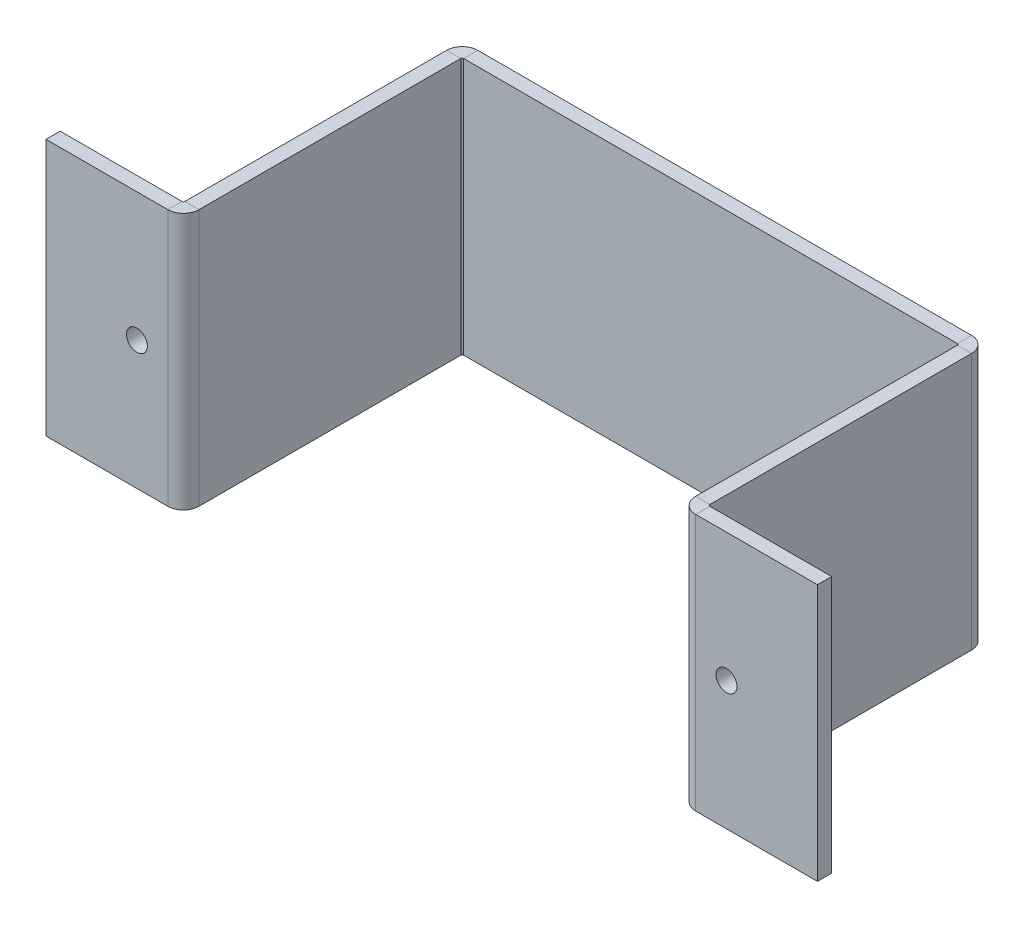
ISO-10303-21;
HEADER;
FILE_DESCRIPTION(('STEP AP214'),'2;1');
FILE_NAME('part.step','',(''),(''),'','','');
FILE_SCHEMA(('AUTOMOTIVE_DESIGN { 1 0 10303 214 1 1 1 1 }'));
ENDSEC;
DATA;
#1=APPLICATION_CONTEXT('core data for automotive mechanical design processes');
#2=APPLICATION_PROTOCOL_DEFINITION('international standard','automotive_design',2000,#1);
#3=PRODUCT_CONTEXT('',#1,'mechanical');
#4=PRODUCT('Part','Part','',(#3));
#5=PRODUCT_RELATED_PRODUCT_CATEGORY('part','',(#4));
#6=PRODUCT_DEFINITION_FORMATION('','',#4);
#7=PRODUCT_DEFINITION_CONTEXT('part definition',#1,'design');
#8=PRODUCT_DEFINITION('design','',#6,#7);
#9=PRODUCT_DEFINITION_SHAPE('','',#8);
#10=(LENGTH_UNIT() NAMED_UNIT(*) SI_UNIT(.MILLI.,.METRE.));
#11=(NAMED_UNIT(*) PLANE_ANGLE_UNIT() SI_UNIT($,.RADIAN.));
#12=(NAMED_UNIT(*) SI_UNIT($,.STERADIAN.) SOLID_ANGLE_UNIT());
#13=UNCERTAINTY_MEASURE_WITH_UNIT(LENGTH_MEASURE(1.E-05),#10,'distance_accuracy_value','');
#14=(GEOMETRIC_REPRESENTATION_CONTEXT(3) GLOBAL_UNCERTAINTY_ASSIGNED_CONTEXT((#13)) GLOBAL_UNIT_ASSIGNED_CONTEXT((#10,
#11,#12)) REPRESENTATION_CONTEXT('',''));
#15=CARTESIAN_POINT('',(0.,0.,0.));
#16=DIRECTION('',(0.,0.,1.));
#17=DIRECTION('',(1.,0.,0.));
#18=AXIS2_PLACEMENT_3D('',#15,#16,#17);
#19=CARTESIAN_POINT('',(45.14,-15.035,-0.83));
#20=DIRECTION('',(0.,0.,1.));
#21=DIRECTION('',(1.,0.,0.));
#22=AXIS2_PLACEMENT_3D('',#19,#20,#21);
#23=PLANE('',#22);
#24=DIRECTION('',(-1.,0.,0.));
#25=VECTOR('',#24,1.);
#26=CARTESIAN_POINT('',(45.14,15.035,-0.83));
#27=LINE('',#26,#25);
#28=CARTESIAN_POINT('',(45.14,15.035,-0.83));
#29=VERTEX_POINT('',#28);
#30=CARTESIAN_POINT('',(30.89,15.035,-0.830000000000008));
#31=VERTEX_POINT('',#30);
#32=EDGE_CURVE('E199',#29,#31,#27,.T.);
#33=ORIENTED_EDGE('',*,*,#32,.F.);
#34=DIRECTION('',(0.,1.,0.));
#35=VECTOR('',#34,1.);
#36=CARTESIAN_POINT('',(45.14,-15.035,-0.83));
#37=LINE('',#36,#35);
#38=CARTESIAN_POINT('',(45.14,-15.035,-0.83));
#39=VERTEX_POINT('',#38);
#40=EDGE_CURVE('E192',#39,#29,#37,.T.);
#41=ORIENTED_EDGE('',*,*,#40,.F.);
#42=DIRECTION('',(-1.,0.,0.));
#43=VECTOR('',#42,1.);
#44=CARTESIAN_POINT('',(45.14,-15.035,-0.83));
#45=LINE('',#44,#43);
#46=CARTESIAN_POINT('',(30.89,-15.035,-0.830000000000008));
#47=VERTEX_POINT('',#46);
#48=EDGE_CURVE('E197',#39,#47,#45,.T.);
#49=ORIENTED_EDGE('',*,*,#48,.T.);
#50=DIRECTION('',(0.,1.,0.));
#51=VECTOR('',#50,1.);
#52=CARTESIAN_POINT('',(30.89,-15.035,-0.830000000000008));
#53=LINE('',#52,#51);
#54=EDGE_CURVE('E217',#47,#31,#53,.T.);
#55=ORIENTED_EDGE('',*,*,#54,.T.);
#56=EDGE_LOOP('',(#33,#41,#49,#55));
#57=FACE_BOUND('',#56,.T.);
#58=CARTESIAN_POINT('',(34.5,0.,-0.830000000000006));
#59=DIRECTION('',(0.,0.,1.));
#60=DIRECTION('',(1.,0.,0.));
#61=AXIS2_PLACEMENT_3D('',#58,#59,#60);
#62=CIRCLE('',#61,3.17500000000001);
#63=CARTESIAN_POINT('',(37.675,0.,-0.830000000000004));
#64=VERTEX_POINT('',#63);
#65=EDGE_CURVE('E11',#64,#64,#62,.F.);
#66=ORIENTED_EDGE('',*,*,#65,.F.);
#67=EDGE_LOOP('',(#66));
#68=FACE_BOUND('',#67,.T.);
#69=ADVANCED_FACE('F33',(#57,#68),#23,.F.);
#70=CARTESIAN_POINT('',(45.14,0.,0.));
#71=DIRECTION('',(-1.,0.,0.));
#72=DIRECTION('',(0.,0.,1.));
#73=AXIS2_PLACEMENT_3D('',#70,#71,#72);
#74=PLANE('',#73);
#75=ORIENTED_EDGE('',*,*,#40,.T.);
#76=DIRECTION('',(0.,0.,1.));
#77=VECTOR('',#76,1.);
#78=CARTESIAN_POINT('',(45.14,15.035,0.83));
#79=LINE('',#78,#77);
#80=CARTESIAN_POINT('',(45.14,15.035,0.83));
#81=VERTEX_POINT('',#80);
#82=EDGE_CURVE('E202',#29,#81,#79,.T.);
#83=ORIENTED_EDGE('',*,*,#82,.T.);
#84=DIRECTION('',(0.,-1.,0.));
#85=VECTOR('',#84,1.);
#86=CARTESIAN_POINT('',(45.14,-15.035,0.83));
#87=LINE('',#86,#85);
#88=CARTESIAN_POINT('',(45.14,-15.035,0.83));
#89=VERTEX_POINT('',#88);
#90=EDGE_CURVE('E207',#81,#89,#87,.T.);
#91=ORIENTED_EDGE('',*,*,#90,.T.);
#92=DIRECTION('',(0.,0.,-1.));
#93=VECTOR('',#92,1.);
#94=CARTESIAN_POINT('',(45.14,-15.035,0.83));
#95=LINE('',#94,#93);
#96=EDGE_CURVE('E206',#89,#39,#95,.T.);
#97=ORIENTED_EDGE('',*,*,#96,.T.);
#98=EDGE_LOOP('',(#75,#83,#91,#97));
#99=FACE_BOUND('',#98,.T.);
#100=ADVANCED_FACE('F35',(#99),#74,.F.);
#101=CARTESIAN_POINT('',(-45.14,0.,0.));
#102=DIRECTION('',(-1.,0.,0.));
#103=DIRECTION('',(0.,0.,1.));
#104=AXIS2_PLACEMENT_3D('',#101,#102,#103);
#105=PLANE('',#104);
#106=DIRECTION('',(0.,1.,0.));
#107=VECTOR('',#106,1.);
#108=CARTESIAN_POINT('',(-45.14,-15.035,-0.829999999999976));
#109=LINE('',#108,#107);
#110=CARTESIAN_POINT('',(-45.14,-15.035,-0.829999999999976));
#111=VERTEX_POINT('',#110);
#112=CARTESIAN_POINT('',(-45.14,15.035,-0.829999999999976));
#113=VERTEX_POINT('',#112);
#114=EDGE_CURVE('E295',#111,#113,#109,.T.);
#115=ORIENTED_EDGE('',*,*,#114,.F.);
#116=DIRECTION('',(0.,0.,-1.));
#117=VECTOR('',#116,1.);
#118=CARTESIAN_POINT('',(-45.14,-15.035,0.830000000000024));
#119=LINE('',#118,#117);
#120=CARTESIAN_POINT('',(-45.14,-15.035,0.830000000000024));
#121=VERTEX_POINT('',#120);
#122=EDGE_CURVE('E41',#121,#111,#119,.T.);
#123=ORIENTED_EDGE('',*,*,#122,.F.);
#124=DIRECTION('',(0.,-1.,0.));
#125=VECTOR('',#124,1.);
#126=CARTESIAN_POINT('',(-45.14,-15.035,0.830000000000024));
#127=LINE('',#126,#125);
#128=CARTESIAN_POINT('',(-45.14,15.035,0.830000000000024));
#129=VERTEX_POINT('',#128);
#130=EDGE_CURVE('E48',#129,#121,#127,.T.);
#131=ORIENTED_EDGE('',*,*,#130,.F.);
#132=DIRECTION('',(0.,0.,1.));
#133=VECTOR('',#132,1.);
#134=CARTESIAN_POINT('',(-45.14,15.035,0.830000000000024));
#135=LINE('',#134,#133);
#136=EDGE_CURVE('E57',#113,#129,#135,.T.);
#137=ORIENTED_EDGE('',*,*,#136,.F.);
#138=EDGE_LOOP('',(#115,#123,#131,#137));
#139=FACE_BOUND('',#138,.T.);
#140=ADVANCED_FACE('F411',(#139),#105,.T.);
#141=CARTESIAN_POINT('',(45.14,15.035,0.83));
#142=DIRECTION('',(0.,-1.,0.));
#143=DIRECTION('',(0.,0.,-1.));
#144=AXIS2_PLACEMENT_3D('',#141,#142,#143);
#145=PLANE('',#144);
#146=DIRECTION('',(-1.,0.,0.));
#147=VECTOR('',#146,1.);
#148=CARTESIAN_POINT('',(45.14,15.035,0.83));
#149=LINE('',#148,#147);
#150=CARTESIAN_POINT('',(30.89,15.035,0.829999999999992));
#151=VERTEX_POINT('',#150);
#152=EDGE_CURVE('E306',#81,#151,#149,.T.);
#153=ORIENTED_EDGE('',*,*,#152,.F.);
#154=ORIENTED_EDGE('',*,*,#82,.F.);
#155=ORIENTED_EDGE('',*,*,#32,.T.);
#156=DIRECTION('',(0.,0.,1.));
#157=VECTOR('',#156,1.);
#158=CARTESIAN_POINT('',(30.89,15.035,0.829999999999992));
#159=LINE('',#158,#157);
#160=EDGE_CURVE('E303',#31,#151,#159,.T.);
#161=ORIENTED_EDGE('',*,*,#160,.T.);
#162=EDGE_LOOP('',(#153,#154,#155,#161));
#163=FACE_BOUND('',#162,.T.);
#164=ADVANCED_FACE('F489',(#163),#145,.F.);
#165=CARTESIAN_POINT('',(45.14,-15.035,0.83));
#166=DIRECTION('',(0.,0.,-1.));
#167=DIRECTION('',(-1.,0.,0.));
#168=AXIS2_PLACEMENT_3D('',#165,#166,#167);
#169=PLANE('',#168);
#170=CARTESIAN_POINT('',(34.5,0.,0.830000000000024));
#171=DIRECTION('',(0.,0.,-1.));
#172=DIRECTION('',(-1.,0.,0.));
#173=AXIS2_PLACEMENT_3D('',#170,#171,#172);
#174=CIRCLE('',#173,1.225);
#175=CARTESIAN_POINT('',(33.275,0.,0.830000000000024));
#176=VERTEX_POINT('',#175);
#177=EDGE_CURVE('E203',#176,#176,#174,.T.);
#178=ORIENTED_EDGE('',*,*,#177,.T.);
#179=EDGE_LOOP('',(#178));
#180=FACE_BOUND('',#179,.T.);
#181=DIRECTION('',(-1.,0.,0.));
#182=VECTOR('',#181,1.);
#183=CARTESIAN_POINT('',(45.14,-15.035,0.83));
#184=LINE('',#183,#182);
#185=CARTESIAN_POINT('',(30.89,-15.035,0.829999999999992));
#186=VERTEX_POINT('',#185);
#187=EDGE_CURVE('E354',#89,#186,#184,.T.);
#188=ORIENTED_EDGE('',*,*,#187,.F.);
#189=ORIENTED_EDGE('',*,*,#90,.F.);
#190=ORIENTED_EDGE('',*,*,#152,.T.);
#191=DIRECTION('',(0.,-1.,0.));
#192=VECTOR('',#191,1.);
#193=CARTESIAN_POINT('',(30.89,-15.035,0.829999999999992));
#194=LINE('',#193,#192);
#195=EDGE_CURVE('E309',#151,#186,#194,.T.);
#196=ORIENTED_EDGE('',*,*,#195,.T.);
#197=EDGE_LOOP('',(#188,#189,#190,#196));
#198=FACE_BOUND('',#197,.T.);
#199=ADVANCED_FACE('F492',(#180,#198),#169,.F.);
#200=CARTESIAN_POINT('',(45.14,-15.035,0.83));
#201=DIRECTION('',(0.,1.,0.));
#202=DIRECTION('',(0.,0.,1.));
#203=AXIS2_PLACEMENT_3D('',#200,#201,#202);
#204=PLANE('',#203);
#205=DIRECTION('',(0.,0.,-1.));
#206=VECTOR('',#205,1.);
#207=CARTESIAN_POINT('',(30.89,-15.035,0.829999999999992));
#208=LINE('',#207,#206);
#209=EDGE_CURVE('E215',#186,#47,#208,.T.);
#210=ORIENTED_EDGE('',*,*,#209,.T.);
#211=ORIENTED_EDGE('',*,*,#48,.F.);
#212=ORIENTED_EDGE('',*,*,#96,.F.);
#213=ORIENTED_EDGE('',*,*,#187,.T.);
#214=EDGE_LOOP('',(#210,#211,#212,#213));
#215=FACE_BOUND('',#214,.T.);
#216=ADVANCED_FACE('F213',(#215),#204,.F.);
#217=CARTESIAN_POINT('',(30.89,0.,-1.00000000000001));
#218=DIRECTION('',(0.,-1.,0.));
#219=DIRECTION('',(0.,0.,-1.));
#220=AXIS2_PLACEMENT_3D('',#217,#218,#219);
#221=CYLINDRICAL_SURFACE('',#220,0.170000000000022);
#222=CARTESIAN_POINT('',(30.89,15.035,-1.00000000000001));
#223=DIRECTION('',(0.,-1.,0.));
#224=DIRECTION('',(0.,0.,1.));
#225=AXIS2_PLACEMENT_3D('',#222,#223,#224);
#226=CIRCLE('',#225,0.170000000000022);
#227=CARTESIAN_POINT('',(30.72,15.035,-1.00000000000001));
#228=VERTEX_POINT('',#227);
#229=EDGE_CURVE('E225',#31,#228,#226,.T.);
#230=ORIENTED_EDGE('',*,*,#229,.F.);
#231=ORIENTED_EDGE('',*,*,#54,.F.);
#232=CARTESIAN_POINT('',(30.89,-15.035,-1.00000000000001));
#233=DIRECTION('',(0.,-1.,0.));
#234=DIRECTION('',(0.,0.,1.));
#235=AXIS2_PLACEMENT_3D('',#232,#233,#234);
#236=CIRCLE('',#235,0.170000000000022);
#237=CARTESIAN_POINT('',(30.72,-15.035,-1.00000000000001));
#238=VERTEX_POINT('',#237);
#239=EDGE_CURVE('E226',#47,#238,#236,.T.);
#240=ORIENTED_EDGE('',*,*,#239,.T.);
#241=DIRECTION('',(0.,1.,0.));
#242=VECTOR('',#241,1.);
#243=CARTESIAN_POINT('',(30.72,-15.035,-1.00000000000001));
#244=LINE('',#243,#242);
#245=EDGE_CURVE('E222',#238,#228,#244,.T.);
#246=ORIENTED_EDGE('',*,*,#245,.T.);
#247=EDGE_LOOP('',(#230,#231,#240,#246));
#248=FACE_BOUND('',#247,.T.);
#249=ADVANCED_FACE('F448',(#248),#221,.F.);
#250=CARTESIAN_POINT('',(30.89,15.035,0.830000000000015));
#251=DIRECTION('',(0.,-1.,0.));
#252=DIRECTION('',(0.,0.,-1.));
#253=AXIS2_PLACEMENT_3D('',#250,#251,#252);
#254=PLANE('',#253);
#255=CARTESIAN_POINT('',(30.89,15.035,-1.00000000000001));
#256=DIRECTION('',(0.,-1.,0.));
#257=DIRECTION('',(0.,0.,1.));
#258=AXIS2_PLACEMENT_3D('',#255,#256,#257);
#259=CIRCLE('',#258,1.83000000000002);
#260=CARTESIAN_POINT('',(29.06,15.035,-1.00000000000001));
#261=VERTEX_POINT('',#260);
#262=EDGE_CURVE('E312',#151,#261,#259,.T.);
#263=ORIENTED_EDGE('',*,*,#262,.F.);
#264=ORIENTED_EDGE('',*,*,#160,.F.);
#265=ORIENTED_EDGE('',*,*,#229,.T.);
#266=DIRECTION('',(-1.,0.,0.));
#267=VECTOR('',#266,1.);
#268=CARTESIAN_POINT('',(29.06,15.035,-1.00000000000001));
#269=LINE('',#268,#267);
#270=EDGE_CURVE('E229',#228,#261,#269,.T.);
#271=ORIENTED_EDGE('',*,*,#270,.T.);
#272=EDGE_LOOP('',(#263,#264,#265,#271));
#273=FACE_BOUND('',#272,.T.);
#274=ADVANCED_FACE('F451',(#273),#254,.F.);
#275=CARTESIAN_POINT('',(30.89,0.,-1.00000000000001));
#276=DIRECTION('',(0.,-1.,0.));
#277=DIRECTION('',(0.,0.,-1.));
#278=AXIS2_PLACEMENT_3D('',#275,#276,#277);
#279=CYLINDRICAL_SURFACE('',#278,1.83000000000002);
#280=CARTESIAN_POINT('',(30.89,-15.035,-1.00000000000001));
#281=DIRECTION('',(0.,-1.,0.));
#282=DIRECTION('',(0.,0.,1.));
#283=AXIS2_PLACEMENT_3D('',#280,#281,#282);
#284=CIRCLE('',#283,1.83000000000002);
#285=CARTESIAN_POINT('',(29.06,-15.035,-1.00000000000001));
#286=VERTEX_POINT('',#285);
#287=EDGE_CURVE('E358',#186,#286,#284,.T.);
#288=ORIENTED_EDGE('',*,*,#287,.F.);
#289=ORIENTED_EDGE('',*,*,#195,.F.);
#290=ORIENTED_EDGE('',*,*,#262,.T.);
#291=DIRECTION('',(0.,-1.,0.));
#292=VECTOR('',#291,1.);
#293=CARTESIAN_POINT('',(29.06,-15.035,-1.00000000000001));
#294=LINE('',#293,#292);
#295=EDGE_CURVE('E315',#261,#286,#294,.T.);
#296=ORIENTED_EDGE('',*,*,#295,.T.);
#297=EDGE_LOOP('',(#288,#289,#290,#296));
#298=FACE_BOUND('',#297,.T.);
#299=ADVANCED_FACE('F496',(#298),#279,.T.);
#300=CARTESIAN_POINT('',(30.89,-15.035,0.830000000000015));
#301=DIRECTION('',(0.,1.,0.));
#302=DIRECTION('',(0.,0.,1.));
#303=AXIS2_PLACEMENT_3D('',#300,#301,#302);
#304=PLANE('',#303);
#305=DIRECTION('',(1.,0.,0.));
#306=VECTOR('',#305,1.);
#307=CARTESIAN_POINT('',(29.06,-15.035,-1.00000000000001));
#308=LINE('',#307,#306);
#309=EDGE_CURVE('E242',#286,#238,#308,.T.);
#310=ORIENTED_EDGE('',*,*,#309,.T.);
#311=ORIENTED_EDGE('',*,*,#239,.F.);
#312=ORIENTED_EDGE('',*,*,#209,.F.);
#313=ORIENTED_EDGE('',*,*,#287,.T.);
#314=EDGE_LOOP('',(#310,#311,#312,#313));
#315=FACE_BOUND('',#314,.T.);
#316=ADVANCED_FACE('F457',(#315),#304,.F.);
#317=CARTESIAN_POINT('',(30.72,-15.035,-1.00000000000001));
#318=DIRECTION('',(-1.,0.,0.));
#319=DIRECTION('',(0.,0.,1.));
#320=AXIS2_PLACEMENT_3D('',#317,#318,#319);
#321=PLANE('',#320);
#322=DIRECTION('',(0.,0.,-1.));
#323=VECTOR('',#322,1.);
#324=CARTESIAN_POINT('',(30.72,15.035,-1.00000000000001));
#325=LINE('',#324,#323);
#326=CARTESIAN_POINT('',(30.72,15.035,-31.63));
#327=VERTEX_POINT('',#326);
#328=EDGE_CURVE('E235',#228,#327,#325,.T.);
#329=ORIENTED_EDGE('',*,*,#328,.F.);
#330=ORIENTED_EDGE('',*,*,#245,.F.);
#331=DIRECTION('',(0.,0.,-1.));
#332=VECTOR('',#331,1.);
#333=CARTESIAN_POINT('',(30.72,-15.035,-1.00000000000001));
#334=LINE('',#333,#332);
#335=CARTESIAN_POINT('',(30.72,-15.035,-31.63));
#336=VERTEX_POINT('',#335);
#337=EDGE_CURVE('E236',#238,#336,#334,.T.);
#338=ORIENTED_EDGE('',*,*,#337,.T.);
#339=DIRECTION('',(0.,1.,0.));
#340=VECTOR('',#339,1.);
#341=CARTESIAN_POINT('',(30.72,-15.035,-31.63));
#342=LINE('',#341,#340);
#343=EDGE_CURVE('E232',#336,#327,#342,.T.);
#344=ORIENTED_EDGE('',*,*,#343,.T.);
#345=EDGE_LOOP('',(#329,#330,#338,#344));
#346=FACE_BOUND('',#345,.T.);
#347=ADVANCED_FACE('F453',(#346),#321,.F.);
#348=CARTESIAN_POINT('',(29.06,15.035,-1.00000000000001));
#349=DIRECTION('',(0.,-1.,0.));
#350=DIRECTION('',(0.,0.,-1.));
#351=AXIS2_PLACEMENT_3D('',#348,#349,#350);
#352=PLANE('',#351);
#353=DIRECTION('',(0.,0.,-1.));
#354=VECTOR('',#353,1.);
#355=CARTESIAN_POINT('',(29.06,15.035,-1.00000000000001));
#356=LINE('',#355,#354);
#357=CARTESIAN_POINT('',(29.06,15.035,-31.63));
#358=VERTEX_POINT('',#357);
#359=EDGE_CURVE('E318',#261,#358,#356,.T.);
#360=ORIENTED_EDGE('',*,*,#359,.F.);
#361=ORIENTED_EDGE('',*,*,#270,.F.);
#362=ORIENTED_EDGE('',*,*,#328,.T.);
#363=DIRECTION('',(-1.,0.,0.));
#364=VECTOR('',#363,1.);
#365=CARTESIAN_POINT('',(29.06,15.035,-31.63));
#366=LINE('',#365,#364);
#367=EDGE_CURVE('E239',#327,#358,#366,.T.);
#368=ORIENTED_EDGE('',*,*,#367,.T.);
#369=EDGE_LOOP('',(#360,#361,#362,#368));
#370=FACE_BOUND('',#369,.T.);
#371=ADVANCED_FACE('F456',(#370),#352,.F.);
#372=CARTESIAN_POINT('',(29.06,-15.035,-1.00000000000001));
#373=DIRECTION('',(1.,0.,0.));
#374=DIRECTION('',(0.,0.,-1.));
#375=AXIS2_PLACEMENT_3D('',#372,#373,#374);
#376=PLANE('',#375);
#377=DIRECTION('',(0.,0.,-1.));
#378=VECTOR('',#377,1.);
#379=CARTESIAN_POINT('',(29.06,-15.035,-1.00000000000001));
#380=LINE('',#379,#378);
#381=CARTESIAN_POINT('',(29.06,-15.035,-31.63));
#382=VERTEX_POINT('',#381);
#383=EDGE_CURVE('E363',#286,#382,#380,.T.);
#384=ORIENTED_EDGE('',*,*,#383,.F.);
#385=ORIENTED_EDGE('',*,*,#295,.F.);
#386=ORIENTED_EDGE('',*,*,#359,.T.);
#387=DIRECTION('',(0.,-1.,0.));
#388=VECTOR('',#387,1.);
#389=CARTESIAN_POINT('',(29.06,-15.035,-31.63));
#390=LINE('',#389,#388);
#391=EDGE_CURVE('E321',#358,#382,#390,.T.);
#392=ORIENTED_EDGE('',*,*,#391,.T.);
#393=EDGE_LOOP('',(#384,#385,#386,#392));
#394=FACE_BOUND('',#393,.T.);
#395=ADVANCED_FACE('F500',(#394),#376,.F.);
#396=CARTESIAN_POINT('',(29.06,-15.035,-1.00000000000001));
#397=DIRECTION('',(0.,1.,0.));
#398=DIRECTION('',(0.,0.,1.));
#399=AXIS2_PLACEMENT_3D('',#396,#397,#398);
#400=PLANE('',#399);
#401=DIRECTION('',(1.,0.,0.));
#402=VECTOR('',#401,1.);
#403=CARTESIAN_POINT('',(29.06,-15.035,-31.63));
#404=LINE('',#403,#402);
#405=EDGE_CURVE('E253',#382,#336,#404,.T.);
#406=ORIENTED_EDGE('',*,*,#405,.T.);
#407=ORIENTED_EDGE('',*,*,#337,.F.);
#408=ORIENTED_EDGE('',*,*,#309,.F.);
#409=ORIENTED_EDGE('',*,*,#383,.T.);
#410=EDGE_LOOP('',(#406,#407,#408,#409));
#411=FACE_BOUND('',#410,.T.);
#412=ADVANCED_FACE('F463',(#411),#400,.F.);
#413=CARTESIAN_POINT('',(28.89,0.,-31.63));
#414=DIRECTION('',(0.,1.,0.));
#415=DIRECTION('',(0.,0.,1.));
#416=AXIS2_PLACEMENT_3D('',#413,#414,#415);
#417=CYLINDRICAL_SURFACE('',#416,1.83000000000001);
#418=CARTESIAN_POINT('',(28.89,15.035,-31.63));
#419=DIRECTION('',(0.,1.,0.));
#420=DIRECTION('',(1.,0.,0.));
#421=AXIS2_PLACEMENT_3D('',#418,#419,#420);
#422=CIRCLE('',#421,1.83000000000001);
#423=CARTESIAN_POINT('',(28.89,15.035,-33.46));
#424=VERTEX_POINT('',#423);
#425=EDGE_CURVE('E246',#327,#424,#422,.T.);
#426=ORIENTED_EDGE('',*,*,#425,.F.);
#427=ORIENTED_EDGE('',*,*,#343,.F.);
#428=CARTESIAN_POINT('',(28.89,-15.035,-31.63));
#429=DIRECTION('',(0.,1.,0.));
#430=DIRECTION('',(1.,0.,0.));
#431=AXIS2_PLACEMENT_3D('',#428,#429,#430);
#432=CIRCLE('',#431,1.83000000000001);
#433=CARTESIAN_POINT('',(28.89,-15.035,-33.46));
#434=VERTEX_POINT('',#433);
#435=EDGE_CURVE('E247',#336,#434,#432,.T.);
#436=ORIENTED_EDGE('',*,*,#435,.T.);
#437=DIRECTION('',(0.,1.,0.));
#438=VECTOR('',#437,1.);
#439=CARTESIAN_POINT('',(28.89,-15.035,-33.46));
#440=LINE('',#439,#438);
#441=EDGE_CURVE('E243',#434,#424,#440,.T.);
#442=ORIENTED_EDGE('',*,*,#441,.T.);
#443=EDGE_LOOP('',(#426,#427,#436,#442));
#444=FACE_BOUND('',#443,.T.);
#445=ADVANCED_FACE('F459',(#444),#417,.T.);
#446=CARTESIAN_POINT('',(29.06,15.035,-31.63));
#447=DIRECTION('',(0.,-1.,0.));
#448=DIRECTION('',(0.,0.,-1.));
#449=AXIS2_PLACEMENT_3D('',#446,#447,#448);
#450=PLANE('',#449);
#451=CARTESIAN_POINT('',(28.89,15.035,-31.63));
#452=DIRECTION('',(0.,1.,0.));
#453=DIRECTION('',(1.,0.,0.));
#454=AXIS2_PLACEMENT_3D('',#451,#452,#453);
#455=CIRCLE('',#454,0.170000000000003);
#456=CARTESIAN_POINT('',(28.89,15.035,-31.8));
#457=VERTEX_POINT('',#456);
#458=EDGE_CURVE('E324',#358,#457,#455,.T.);
#459=ORIENTED_EDGE('',*,*,#458,.F.);
#460=ORIENTED_EDGE('',*,*,#367,.F.);
#461=ORIENTED_EDGE('',*,*,#425,.T.);
#462=DIRECTION('',(0.,0.,1.));
#463=VECTOR('',#462,1.);
#464=CARTESIAN_POINT('',(28.89,15.035,-31.8));
#465=LINE('',#464,#463);
#466=EDGE_CURVE('E250',#424,#457,#465,.T.);
#467=ORIENTED_EDGE('',*,*,#466,.T.);
#468=EDGE_LOOP('',(#459,#460,#461,#467));
#469=FACE_BOUND('',#468,.T.);
#470=ADVANCED_FACE('F462',(#469),#450,.F.);
#471=CARTESIAN_POINT('',(28.89,0.,-31.63));
#472=DIRECTION('',(0.,1.,0.));
#473=DIRECTION('',(0.,0.,1.));
#474=AXIS2_PLACEMENT_3D('',#471,#472,#473);
#475=CYLINDRICAL_SURFACE('',#474,0.170000000000003);
#476=CARTESIAN_POINT('',(28.89,-15.035,-31.63));
#477=DIRECTION('',(0.,1.,0.));
#478=DIRECTION('',(1.,0.,0.));
#479=AXIS2_PLACEMENT_3D('',#476,#477,#478);
#480=CIRCLE('',#479,0.170000000000003);
#481=CARTESIAN_POINT('',(28.89,-15.035,-31.8));
#482=VERTEX_POINT('',#481);
#483=EDGE_CURVE('E368',#382,#482,#480,.T.);
#484=ORIENTED_EDGE('',*,*,#483,.F.);
#485=ORIENTED_EDGE('',*,*,#391,.F.);
#486=ORIENTED_EDGE('',*,*,#458,.T.);
#487=DIRECTION('',(0.,-1.,0.));
#488=VECTOR('',#487,1.);
#489=CARTESIAN_POINT('',(28.89,-15.035,-31.8));
#490=LINE('',#489,#488);
#491=EDGE_CURVE('E327',#457,#482,#490,.T.);
#492=ORIENTED_EDGE('',*,*,#491,.T.);
#493=EDGE_LOOP('',(#484,#485,#486,#492));
#494=FACE_BOUND('',#493,.T.);
#495=ADVANCED_FACE('F504',(#494),#475,.F.);
#496=CARTESIAN_POINT('',(29.06,-15.035,-31.63));
#497=DIRECTION('',(0.,1.,0.));
#498=DIRECTION('',(0.,0.,1.));
#499=AXIS2_PLACEMENT_3D('',#496,#497,#498);
#500=PLANE('',#499);
#501=DIRECTION('',(0.,0.,-1.));
#502=VECTOR('',#501,1.);
#503=CARTESIAN_POINT('',(28.89,-15.035,-31.8));
#504=LINE('',#503,#502);
#505=EDGE_CURVE('E264',#482,#434,#504,.T.);
#506=ORIENTED_EDGE('',*,*,#505,.T.);
#507=ORIENTED_EDGE('',*,*,#435,.F.);
#508=ORIENTED_EDGE('',*,*,#405,.F.);
#509=ORIENTED_EDGE('',*,*,#483,.T.);
#510=EDGE_LOOP('',(#506,#507,#508,#509));
#511=FACE_BOUND('',#510,.T.);
#512=ADVANCED_FACE('F469',(#511),#500,.F.);
#513=CARTESIAN_POINT('',(28.89,-15.035,-33.46));
#514=DIRECTION('',(0.,0.,1.));
#515=DIRECTION('',(1.,0.,0.));
#516=AXIS2_PLACEMENT_3D('',#513,#514,#515);
#517=PLANE('',#516);
#518=DIRECTION('',(-1.,0.,0.));
#519=VECTOR('',#518,1.);
#520=CARTESIAN_POINT('',(28.89,15.035,-33.46));
#521=LINE('',#520,#519);
#522=CARTESIAN_POINT('',(-28.89,15.035,-33.46));
#523=VERTEX_POINT('',#522);
#524=EDGE_CURVE('E257',#424,#523,#521,.T.);
#525=ORIENTED_EDGE('',*,*,#524,.F.);
#526=ORIENTED_EDGE('',*,*,#441,.F.);
#527=DIRECTION('',(-1.,0.,0.));
#528=VECTOR('',#527,1.);
#529=CARTESIAN_POINT('',(28.89,-15.035,-33.46));
#530=LINE('',#529,#528);
#531=CARTESIAN_POINT('',(-28.89,-15.035,-33.46));
#532=VERTEX_POINT('',#531);
#533=EDGE_CURVE('E258',#434,#532,#530,.T.);
#534=ORIENTED_EDGE('',*,*,#533,.T.);
#535=DIRECTION('',(0.,1.,0.));
#536=VECTOR('',#535,1.);
#537=CARTESIAN_POINT('',(-28.89,-15.035,-33.46));
#538=LINE('',#537,#536);
#539=EDGE_CURVE('E254',#532,#523,#538,.T.);
#540=ORIENTED_EDGE('',*,*,#539,.T.);
#541=EDGE_LOOP('',(#525,#526,#534,#540));
#542=FACE_BOUND('',#541,.T.);
#543=ADVANCED_FACE('F465',(#542),#517,.F.);
#544=CARTESIAN_POINT('',(28.89,15.035,-31.8));
#545=DIRECTION('',(0.,-1.,0.));
#546=DIRECTION('',(0.,0.,-1.));
#547=AXIS2_PLACEMENT_3D('',#544,#545,#546);
#548=PLANE('',#547);
#549=DIRECTION('',(-1.,0.,0.));
#550=VECTOR('',#549,1.);
#551=CARTESIAN_POINT('',(28.89,15.035,-31.8));
#552=LINE('',#551,#550);
#553=CARTESIAN_POINT('',(-28.89,15.035,-31.8));
#554=VERTEX_POINT('',#553);
#555=EDGE_CURVE('E330',#457,#554,#552,.T.);
#556=ORIENTED_EDGE('',*,*,#555,.F.);
#557=ORIENTED_EDGE('',*,*,#466,.F.);
#558=ORIENTED_EDGE('',*,*,#524,.T.);
#559=DIRECTION('',(0.,0.,1.));
#560=VECTOR('',#559,1.);
#561=CARTESIAN_POINT('',(-28.89,15.035,-31.8));
#562=LINE('',#561,#560);
#563=EDGE_CURVE('E261',#523,#554,#562,.T.);
#564=ORIENTED_EDGE('',*,*,#563,.T.);
#565=EDGE_LOOP('',(#556,#557,#558,#564));
#566=FACE_BOUND('',#565,.T.);
#567=ADVANCED_FACE('F468',(#566),#548,.F.);
#568=CARTESIAN_POINT('',(28.89,-15.035,-31.8));
#569=DIRECTION('',(0.,0.,-1.));
#570=DIRECTION('',(-1.,0.,0.));
#571=AXIS2_PLACEMENT_3D('',#568,#569,#570);
#572=PLANE('',#571);
#573=DIRECTION('',(-1.,0.,0.));
#574=VECTOR('',#573,1.);
#575=CARTESIAN_POINT('',(28.89,-15.035,-31.8));
#576=LINE('',#575,#574);
#577=CARTESIAN_POINT('',(-28.89,-15.035,-31.8));
#578=VERTEX_POINT('',#577);
#579=EDGE_CURVE('E373',#482,#578,#576,.T.);
#580=ORIENTED_EDGE('',*,*,#579,.F.);
#581=ORIENTED_EDGE('',*,*,#491,.F.);
#582=ORIENTED_EDGE('',*,*,#555,.T.);
#583=DIRECTION('',(0.,-1.,0.));
#584=VECTOR('',#583,1.);
#585=CARTESIAN_POINT('',(-28.89,-15.035,-31.8));
#586=LINE('',#585,#584);
#587=EDGE_CURVE('E333',#554,#578,#586,.T.);
#588=ORIENTED_EDGE('',*,*,#587,.T.);
#589=EDGE_LOOP('',(#580,#581,#582,#588));
#590=FACE_BOUND('',#589,.T.);
#591=ADVANCED_FACE('F508',(#590),#572,.F.);
#592=CARTESIAN_POINT('',(28.89,-15.035,-31.8));
#593=DIRECTION('',(0.,1.,0.));
#594=DIRECTION('',(0.,0.,1.));
#595=AXIS2_PLACEMENT_3D('',#592,#593,#594);
#596=PLANE('',#595);
#597=DIRECTION('',(0.,0.,-1.));
#598=VECTOR('',#597,1.);
#599=CARTESIAN_POINT('',(-28.89,-15.035,-31.8));
#600=LINE('',#599,#598);
#601=EDGE_CURVE('E275',#578,#532,#600,.T.);
#602=ORIENTED_EDGE('',*,*,#601,.T.);
#603=ORIENTED_EDGE('',*,*,#533,.F.);
#604=ORIENTED_EDGE('',*,*,#505,.F.);
#605=ORIENTED_EDGE('',*,*,#579,.T.);
#606=EDGE_LOOP('',(#602,#603,#604,#605));
#607=FACE_BOUND('',#606,.T.);
#608=ADVANCED_FACE('F475',(#607),#596,.F.);
#609=CARTESIAN_POINT('',(-28.89,0.,-31.63));
#610=DIRECTION('',(0.,1.,0.));
#611=DIRECTION('',(0.,0.,1.));
#612=AXIS2_PLACEMENT_3D('',#609,#610,#611);
#613=CYLINDRICAL_SURFACE('',#612,1.82999999999998);
#614=CARTESIAN_POINT('',(-28.89,15.035,-31.63));
#615=DIRECTION('',(0.,1.,0.));
#616=DIRECTION('',(0.,0.,-1.));
#617=AXIS2_PLACEMENT_3D('',#614,#615,#616);
#618=CIRCLE('',#617,1.82999999999998);
#619=CARTESIAN_POINT('',(-30.72,15.035,-31.63));
#620=VERTEX_POINT('',#619);
#621=EDGE_CURVE('E268',#523,#620,#618,.T.);
#622=ORIENTED_EDGE('',*,*,#621,.F.);
#623=ORIENTED_EDGE('',*,*,#539,.F.);
#624=CARTESIAN_POINT('',(-28.89,-15.035,-31.63));
#625=DIRECTION('',(0.,1.,0.));
#626=DIRECTION('',(0.,0.,-1.));
#627=AXIS2_PLACEMENT_3D('',#624,#625,#626);
#628=CIRCLE('',#627,1.82999999999998);
#629=CARTESIAN_POINT('',(-30.72,-15.035,-31.63));
#630=VERTEX_POINT('',#629);
#631=EDGE_CURVE('E269',#532,#630,#628,.T.);
#632=ORIENTED_EDGE('',*,*,#631,.T.);
#633=DIRECTION('',(0.,1.,0.));
#634=VECTOR('',#633,1.);
#635=CARTESIAN_POINT('',(-30.72,-15.035,-31.63));
#636=LINE('',#635,#634);
#637=EDGE_CURVE('E265',#630,#620,#636,.T.);
#638=ORIENTED_EDGE('',*,*,#637,.T.);
#639=EDGE_LOOP('',(#622,#623,#632,#638));
#640=FACE_BOUND('',#639,.T.);
#641=ADVANCED_FACE('F471',(#640),#613,.T.);
#642=CARTESIAN_POINT('',(-28.89,15.035,-31.8));
#643=DIRECTION('',(0.,-1.,0.));
#644=DIRECTION('',(0.,0.,-1.));
#645=AXIS2_PLACEMENT_3D('',#642,#643,#644);
#646=PLANE('',#645);
#647=CARTESIAN_POINT('',(-28.89,15.035,-31.63));
#648=DIRECTION('',(0.,1.,0.));
#649=DIRECTION('',(0.,0.,-1.));
#650=AXIS2_PLACEMENT_3D('',#647,#648,#649);
#651=CIRCLE('',#650,0.16999999999999);
#652=CARTESIAN_POINT('',(-29.06,15.035,-31.63));
#653=VERTEX_POINT('',#652);
#654=EDGE_CURVE('E336',#554,#653,#651,.T.);
#655=ORIENTED_EDGE('',*,*,#654,.F.);
#656=ORIENTED_EDGE('',*,*,#563,.F.);
#657=ORIENTED_EDGE('',*,*,#621,.T.);
#658=DIRECTION('',(1.,0.,0.));
#659=VECTOR('',#658,1.);
#660=CARTESIAN_POINT('',(-29.06,15.035,-31.63));
#661=LINE('',#660,#659);
#662=EDGE_CURVE('E272',#620,#653,#661,.T.);
#663=ORIENTED_EDGE('',*,*,#662,.T.);
#664=EDGE_LOOP('',(#655,#656,#657,#663));
#665=FACE_BOUND('',#664,.T.);
#666=ADVANCED_FACE('F474',(#665),#646,.F.);
#667=CARTESIAN_POINT('',(-28.89,0.,-31.63));
#668=DIRECTION('',(0.,1.,0.));
#669=DIRECTION('',(0.,0.,1.));
#670=AXIS2_PLACEMENT_3D('',#667,#668,#669);
#671=CYLINDRICAL_SURFACE('',#670,0.16999999999999);
#672=CARTESIAN_POINT('',(-28.89,-15.035,-31.63));
#673=DIRECTION('',(0.,1.,0.));
#674=DIRECTION('',(0.,0.,-1.));
#675=AXIS2_PLACEMENT_3D('',#672,#673,#674);
#676=CIRCLE('',#675,0.16999999999999);
#677=CARTESIAN_POINT('',(-29.06,-15.035,-31.63));
#678=VERTEX_POINT('',#677);
#679=EDGE_CURVE('E378',#578,#678,#676,.T.);
#680=ORIENTED_EDGE('',*,*,#679,.F.);
#681=ORIENTED_EDGE('',*,*,#587,.F.);
#682=ORIENTED_EDGE('',*,*,#654,.T.);
#683=DIRECTION('',(0.,-1.,0.));
#684=VECTOR('',#683,1.);
#685=CARTESIAN_POINT('',(-29.06,-15.035,-31.63));
#686=LINE('',#685,#684);
#687=EDGE_CURVE('E339',#653,#678,#686,.T.);
#688=ORIENTED_EDGE('',*,*,#687,.T.);
#689=EDGE_LOOP('',(#680,#681,#682,#688));
#690=FACE_BOUND('',#689,.T.);
#691=ADVANCED_FACE('F512',(#690),#671,.F.);
#692=CARTESIAN_POINT('',(-28.89,-15.035,-31.8));
#693=DIRECTION('',(0.,1.,0.));
#694=DIRECTION('',(0.,0.,1.));
#695=AXIS2_PLACEMENT_3D('',#692,#693,#694);
#696=PLANE('',#695);
#697=DIRECTION('',(-1.,0.,0.));
#698=VECTOR('',#697,1.);
#699=CARTESIAN_POINT('',(-29.06,-15.035,-31.63));
#700=LINE('',#699,#698);
#701=EDGE_CURVE('E286',#678,#630,#700,.T.);
#702=ORIENTED_EDGE('',*,*,#701,.T.);
#703=ORIENTED_EDGE('',*,*,#631,.F.);
#704=ORIENTED_EDGE('',*,*,#601,.F.);
#705=ORIENTED_EDGE('',*,*,#679,.T.);
#706=EDGE_LOOP('',(#702,#703,#704,#705));
#707=FACE_BOUND('',#706,.T.);
#708=ADVANCED_FACE('F481',(#707),#696,.F.);
#709=CARTESIAN_POINT('',(-30.72,-15.035,-31.63));
#710=DIRECTION('',(1.,0.,0.));
#711=DIRECTION('',(0.,0.,-1.));
#712=AXIS2_PLACEMENT_3D('',#709,#710,#711);
#713=PLANE('',#712);
#714=DIRECTION('',(0.,0.,1.));
#715=VECTOR('',#714,1.);
#716=CARTESIAN_POINT('',(-30.72,15.035,-31.63));
#717=LINE('',#716,#715);
#718=CARTESIAN_POINT('',(-30.72,15.035,-1.));
#719=VERTEX_POINT('',#718);
#720=EDGE_CURVE('E279',#620,#719,#717,.T.);
#721=ORIENTED_EDGE('',*,*,#720,.F.);
#722=ORIENTED_EDGE('',*,*,#637,.F.);
#723=DIRECTION('',(0.,0.,1.));
#724=VECTOR('',#723,1.);
#725=CARTESIAN_POINT('',(-30.72,-15.035,-31.63));
#726=LINE('',#725,#724);
#727=CARTESIAN_POINT('',(-30.72,-15.035,-1.));
#728=VERTEX_POINT('',#727);
#729=EDGE_CURVE('E280',#630,#728,#726,.T.);
#730=ORIENTED_EDGE('',*,*,#729,.T.);
#731=DIRECTION('',(0.,1.,0.));
#732=VECTOR('',#731,1.);
#733=CARTESIAN_POINT('',(-30.72,-15.035,-1.));
#734=LINE('',#733,#732);
#735=EDGE_CURVE('E276',#728,#719,#734,.T.);
#736=ORIENTED_EDGE('',*,*,#735,.T.);
#737=EDGE_LOOP('',(#721,#722,#730,#736));
#738=FACE_BOUND('',#737,.T.);
#739=ADVANCED_FACE('F477',(#738),#713,.F.);
#740=CARTESIAN_POINT('',(-29.06,15.035,-31.63));
#741=DIRECTION('',(0.,-1.,0.));
#742=DIRECTION('',(0.,0.,-1.));
#743=AXIS2_PLACEMENT_3D('',#740,#741,#742);
#744=PLANE('',#743);
#745=DIRECTION('',(0.,0.,1.));
#746=VECTOR('',#745,1.);
#747=CARTESIAN_POINT('',(-29.06,15.035,-31.63));
#748=LINE('',#747,#746);
#749=CARTESIAN_POINT('',(-29.06,15.035,-1.));
#750=VERTEX_POINT('',#749);
#751=EDGE_CURVE('E342',#653,#750,#748,.T.);
#752=ORIENTED_EDGE('',*,*,#751,.F.);
#753=ORIENTED_EDGE('',*,*,#662,.F.);
#754=ORIENTED_EDGE('',*,*,#720,.T.);
#755=DIRECTION('',(1.,0.,0.));
#756=VECTOR('',#755,1.);
#757=CARTESIAN_POINT('',(-29.06,15.035,-1.));
#758=LINE('',#757,#756);
#759=EDGE_CURVE('E283',#719,#750,#758,.T.);
#760=ORIENTED_EDGE('',*,*,#759,.T.);
#761=EDGE_LOOP('',(#752,#753,#754,#760));
#762=FACE_BOUND('',#761,.T.);
#763=ADVANCED_FACE('F480',(#762),#744,.F.);
#764=CARTESIAN_POINT('',(-29.06,-15.035,-31.63));
#765=DIRECTION('',(-1.,0.,0.));
#766=DIRECTION('',(0.,0.,1.));
#767=AXIS2_PLACEMENT_3D('',#764,#765,#766);
#768=PLANE('',#767);
#769=DIRECTION('',(0.,0.,1.));
#770=VECTOR('',#769,1.);
#771=CARTESIAN_POINT('',(-29.06,-15.035,-31.63));
#772=LINE('',#771,#770);
#773=CARTESIAN_POINT('',(-29.06,-15.035,-1.));
#774=VERTEX_POINT('',#773);
#775=EDGE_CURVE('E383',#678,#774,#772,.T.);
#776=ORIENTED_EDGE('',*,*,#775,.F.);
#777=ORIENTED_EDGE('',*,*,#687,.F.);
#778=ORIENTED_EDGE('',*,*,#751,.T.);
#779=DIRECTION('',(0.,-1.,0.));
#780=VECTOR('',#779,1.);
#781=CARTESIAN_POINT('',(-29.06,-15.035,-1.));
#782=LINE('',#781,#780);
#783=EDGE_CURVE('E345',#750,#774,#782,.T.);
#784=ORIENTED_EDGE('',*,*,#783,.T.);
#785=EDGE_LOOP('',(#776,#777,#778,#784));
#786=FACE_BOUND('',#785,.T.);
#787=ADVANCED_FACE('F422',(#786),#768,.F.);
#788=CARTESIAN_POINT('',(-29.06,-15.035,-31.63));
#789=DIRECTION('',(0.,1.,0.));
#790=DIRECTION('',(0.,0.,1.));
#791=AXIS2_PLACEMENT_3D('',#788,#789,#790);
#792=PLANE('',#791);
#793=DIRECTION('',(-1.,0.,0.));
#794=VECTOR('',#793,1.);
#795=CARTESIAN_POINT('',(-29.06,-15.035,-1.));
#796=LINE('',#795,#794);
#797=EDGE_CURVE('E294',#774,#728,#796,.T.);
#798=ORIENTED_EDGE('',*,*,#797,.T.);
#799=ORIENTED_EDGE('',*,*,#729,.F.);
#800=ORIENTED_EDGE('',*,*,#701,.F.);
#801=ORIENTED_EDGE('',*,*,#775,.T.);
#802=EDGE_LOOP('',(#798,#799,#800,#801));
#803=FACE_BOUND('',#802,.T.);
#804=ADVANCED_FACE('F418',(#803),#792,.F.);
#805=CARTESIAN_POINT('',(-30.89,0.,-1.));
#806=DIRECTION('',(0.,-1.,0.));
#807=DIRECTION('',(0.,0.,-1.));
#808=AXIS2_PLACEMENT_3D('',#805,#806,#807);
#809=CYLINDRICAL_SURFACE('',#808,0.169999999999997);
#810=CARTESIAN_POINT('',(-30.89,15.035,-1.));
#811=DIRECTION('',(0.,-1.,0.));
#812=DIRECTION('',(1.,0.,0.));
#813=AXIS2_PLACEMENT_3D('',#810,#811,#812);
#814=CIRCLE('',#813,0.169999999999997);
#815=CARTESIAN_POINT('',(-30.89,15.035,-0.830000000000004));
#816=VERTEX_POINT('',#815);
#817=EDGE_CURVE('E156',#719,#816,#814,.T.);
#818=ORIENTED_EDGE('',*,*,#817,.F.);
#819=ORIENTED_EDGE('',*,*,#735,.F.);
#820=CARTESIAN_POINT('',(-30.89,-15.035,-1.));
#821=DIRECTION('',(0.,-1.,0.));
#822=DIRECTION('',(1.,0.,0.));
#823=AXIS2_PLACEMENT_3D('',#820,#821,#822);
#824=CIRCLE('',#823,0.169999999999997);
#825=CARTESIAN_POINT('',(-30.89,-15.035,-0.830000000000004));
#826=VERTEX_POINT('',#825);
#827=EDGE_CURVE('E289',#728,#826,#824,.T.);
#828=ORIENTED_EDGE('',*,*,#827,.T.);
#829=DIRECTION('',(0.,1.,0.));
#830=VECTOR('',#829,1.);
#831=CARTESIAN_POINT('',(-30.89,-15.035,-0.829999999999978));
#832=LINE('',#831,#830);
#833=EDGE_CURVE('E287',#826,#816,#832,.T.);
#834=ORIENTED_EDGE('',*,*,#833,.T.);
#835=EDGE_LOOP('',(#818,#819,#828,#834));
#836=FACE_BOUND('',#835,.T.);
#837=ADVANCED_FACE('F413',(#836),#809,.F.);
#838=CARTESIAN_POINT('',(-29.06,15.035,-1.));
#839=DIRECTION('',(0.,-1.,0.));
#840=DIRECTION('',(0.,0.,-1.));
#841=AXIS2_PLACEMENT_3D('',#838,#839,#840);
#842=PLANE('',#841);
#843=CARTESIAN_POINT('',(-30.89,15.035,-1.));
#844=DIRECTION('',(0.,-1.,0.));
#845=DIRECTION('',(1.,0.,0.));
#846=AXIS2_PLACEMENT_3D('',#843,#844,#845);
#847=CIRCLE('',#846,1.83);
#848=CARTESIAN_POINT('',(-30.89,15.035,0.829999999999998));
#849=VERTEX_POINT('',#848);
#850=EDGE_CURVE('E149',#750,#849,#847,.T.);
#851=ORIENTED_EDGE('',*,*,#850,.F.);
#852=ORIENTED_EDGE('',*,*,#759,.F.);
#853=ORIENTED_EDGE('',*,*,#817,.T.);
#854=DIRECTION('',(0.,0.,1.));
#855=VECTOR('',#854,1.);
#856=CARTESIAN_POINT('',(-30.89,15.035,0.830000000000022));
#857=LINE('',#856,#855);
#858=EDGE_CURVE('E291',#816,#849,#857,.T.);
#859=ORIENTED_EDGE('',*,*,#858,.T.);
#860=EDGE_LOOP('',(#851,#852,#853,#859));
#861=FACE_BOUND('',#860,.T.);
#862=ADVANCED_FACE('F485',(#861),#842,.F.);
#863=CARTESIAN_POINT('',(-30.89,0.,-1.));
#864=DIRECTION('',(0.,-1.,0.));
#865=DIRECTION('',(0.,0.,-1.));
#866=AXIS2_PLACEMENT_3D('',#863,#864,#865);
#867=CYLINDRICAL_SURFACE('',#866,1.83);
#868=CARTESIAN_POINT('',(-30.89,-15.035,-1.));
#869=DIRECTION('',(0.,-1.,0.));
#870=DIRECTION('',(1.,0.,0.));
#871=AXIS2_PLACEMENT_3D('',#868,#869,#870);
#872=CIRCLE('',#871,1.83);
#873=CARTESIAN_POINT('',(-30.89,-15.035,0.829999999999998));
#874=VERTEX_POINT('',#873);
#875=EDGE_CURVE('E388',#774,#874,#872,.T.);
#876=ORIENTED_EDGE('',*,*,#875,.F.);
#877=ORIENTED_EDGE('',*,*,#783,.F.);
#878=ORIENTED_EDGE('',*,*,#850,.T.);
#879=DIRECTION('',(0.,-1.,0.));
#880=VECTOR('',#879,1.);
#881=CARTESIAN_POINT('',(-30.89,-15.035,0.830000000000022));
#882=LINE('',#881,#880);
#883=EDGE_CURVE('E348',#849,#874,#882,.T.);
#884=ORIENTED_EDGE('',*,*,#883,.T.);
#885=EDGE_LOOP('',(#876,#877,#878,#884));
#886=FACE_BOUND('',#885,.T.);
#887=ADVANCED_FACE('F424',(#886),#867,.T.);
#888=CARTESIAN_POINT('',(-29.06,-15.035,-1.));
#889=DIRECTION('',(0.,1.,0.));
#890=DIRECTION('',(0.,0.,1.));
#891=AXIS2_PLACEMENT_3D('',#888,#889,#890);
#892=PLANE('',#891);
#893=DIRECTION('',(0.,0.,-1.));
#894=VECTOR('',#893,1.);
#895=CARTESIAN_POINT('',(-30.89,-15.035,0.830000000000022));
#896=LINE('',#895,#894);
#897=EDGE_CURVE('E301',#874,#826,#896,.T.);
#898=ORIENTED_EDGE('',*,*,#897,.T.);
#899=ORIENTED_EDGE('',*,*,#827,.F.);
#900=ORIENTED_EDGE('',*,*,#797,.F.);
#901=ORIENTED_EDGE('',*,*,#875,.T.);
#902=EDGE_LOOP('',(#898,#899,#900,#901));
#903=FACE_BOUND('',#902,.T.);
#904=ADVANCED_FACE('F416',(#903),#892,.F.);
#905=CARTESIAN_POINT('',(-30.89,-15.035,-0.829999999999976));
#906=DIRECTION('',(0.,0.,1.));
#907=DIRECTION('',(1.,0.,0.));
#908=AXIS2_PLACEMENT_3D('',#905,#906,#907);
#909=PLANE('',#908);
#910=CARTESIAN_POINT('',(-34.5,0.,-0.830000000000024));
#911=DIRECTION('',(0.,0.,1.));
#912=DIRECTION('',(1.,0.,0.));
#913=AXIS2_PLACEMENT_3D('',#910,#911,#912);
#914=CIRCLE('',#913,3.17500000000001);
#915=CARTESIAN_POINT('',(-31.325,0.,-0.830000000000024));
#916=VERTEX_POINT('',#915);
#917=EDGE_CURVE('E786',#916,#916,#914,.T.);
#918=ORIENTED_EDGE('',*,*,#917,.T.);
#919=EDGE_LOOP('',(#918));
#920=FACE_BOUND('',#919,.T.);
#921=DIRECTION('',(-1.,0.,0.));
#922=VECTOR('',#921,1.);
#923=CARTESIAN_POINT('',(-30.89,15.035,-0.829999999999976));
#924=LINE('',#923,#922);
#925=EDGE_CURVE('E118',#816,#113,#924,.T.);
#926=ORIENTED_EDGE('',*,*,#925,.F.);
#927=ORIENTED_EDGE('',*,*,#833,.F.);
#928=DIRECTION('',(-1.,0.,0.));
#929=VECTOR('',#928,1.);
#930=CARTESIAN_POINT('',(-30.89,-15.035,-0.829999999999976));
#931=LINE('',#930,#929);
#932=EDGE_CURVE('E297',#826,#111,#931,.T.);
#933=ORIENTED_EDGE('',*,*,#932,.T.);
#934=ORIENTED_EDGE('',*,*,#114,.T.);
#935=EDGE_LOOP('',(#926,#927,#933,#934));
#936=FACE_BOUND('',#935,.T.);
#937=ADVANCED_FACE('F412',(#920,#936),#909,.F.);
#938=CARTESIAN_POINT('',(-30.89,15.035,0.830000000000024));
#939=DIRECTION('',(0.,-1.,0.));
#940=DIRECTION('',(0.,0.,-1.));
#941=AXIS2_PLACEMENT_3D('',#938,#939,#940);
#942=PLANE('',#941);
#943=DIRECTION('',(-1.,0.,0.));
#944=VECTOR('',#943,1.);
#945=CARTESIAN_POINT('',(-30.89,15.035,0.830000000000024));
#946=LINE('',#945,#944);
#947=EDGE_CURVE('E113',#849,#129,#946,.T.);
#948=ORIENTED_EDGE('',*,*,#947,.F.);
#949=ORIENTED_EDGE('',*,*,#858,.F.);
#950=ORIENTED_EDGE('',*,*,#925,.T.);
#951=ORIENTED_EDGE('',*,*,#136,.T.);
#952=EDGE_LOOP('',(#948,#949,#950,#951));
#953=FACE_BOUND('',#952,.T.);
#954=ADVANCED_FACE('F427',(#953),#942,.F.);
#955=CARTESIAN_POINT('',(-30.89,-15.035,0.830000000000024));
#956=DIRECTION('',(0.,0.,-1.));
#957=DIRECTION('',(-1.,0.,0.));
#958=AXIS2_PLACEMENT_3D('',#955,#956,#957);
#959=PLANE('',#958);
#960=CARTESIAN_POINT('',(-34.5,0.,0.830000000000024));
#961=DIRECTION('',(0.,0.,1.));
#962=DIRECTION('',(1.,0.,0.));
#963=AXIS2_PLACEMENT_3D('',#960,#961,#962);
#964=CIRCLE('',#963,1.225);
#965=CARTESIAN_POINT('',(-33.275,0.,0.830000000000024));
#966=VERTEX_POINT('',#965);
#967=EDGE_CURVE('E785',#966,#966,#964,.T.);
#968=ORIENTED_EDGE('',*,*,#967,.F.);
#969=EDGE_LOOP('',(#968));
#970=FACE_BOUND('',#969,.T.);
#971=DIRECTION('',(-1.,0.,0.));
#972=VECTOR('',#971,1.);
#973=CARTESIAN_POINT('',(-30.89,-15.035,0.830000000000024));
#974=LINE('',#973,#972);
#975=EDGE_CURVE('E107',#874,#121,#974,.T.);
#976=ORIENTED_EDGE('',*,*,#975,.F.);
#977=ORIENTED_EDGE('',*,*,#883,.F.);
#978=ORIENTED_EDGE('',*,*,#947,.T.);
#979=ORIENTED_EDGE('',*,*,#130,.T.);
#980=EDGE_LOOP('',(#976,#977,#978,#979));
#981=FACE_BOUND('',#980,.T.);
#982=ADVANCED_FACE('F425',(#970,#981),#959,.F.);
#983=CARTESIAN_POINT('',(-30.89,-15.035,0.830000000000024));
#984=DIRECTION('',(0.,1.,0.));
#985=DIRECTION('',(0.,0.,1.));
#986=AXIS2_PLACEMENT_3D('',#983,#984,#985);
#987=PLANE('',#986);
#988=ORIENTED_EDGE('',*,*,#122,.T.);
#989=ORIENTED_EDGE('',*,*,#932,.F.);
#990=ORIENTED_EDGE('',*,*,#897,.F.);
#991=ORIENTED_EDGE('',*,*,#975,.T.);
#992=EDGE_LOOP('',(#988,#989,#990,#991));
#993=FACE_BOUND('',#992,.T.);
#994=ADVANCED_FACE('F409',(#993),#987,.F.);
#995=CARTESIAN_POINT('',(34.5,0.,0.830000000000024));
#996=DIRECTION('',(0.,0.,-1.));
#997=DIRECTION('',(-1.,0.,0.));
#998=AXIS2_PLACEMENT_3D('',#995,#996,#997);
#999=CYLINDRICAL_SURFACE('',#998,1.225);
#1000=ORIENTED_EDGE('',*,*,#177,.F.);
#1001=EDGE_LOOP('',(#1000));
#1002=FACE_BOUND('',#1001,.T.);
#1003=CARTESIAN_POINT('',(34.5,0.,-2.26000000000002));
#1004=DIRECTION('',(0.,0.,-1.));
#1005=DIRECTION('',(-1.,0.,0.));
#1006=AXIS2_PLACEMENT_3D('',#1003,#1004,#1005);
#1007=CIRCLE('',#1006,1.225);
#1008=CARTESIAN_POINT('',(33.275,0.,-2.26000000000002));
#1009=VERTEX_POINT('',#1008);
#1010=EDGE_CURVE('E789',#1009,#1009,#1007,.T.);
#1011=ORIENTED_EDGE('',*,*,#1010,.T.);
#1012=EDGE_LOOP('',(#1011));
#1013=FACE_BOUND('',#1012,.T.);
#1014=ADVANCED_FACE('F434',(#1002,#1013),#999,.F.);
#1015=CARTESIAN_POINT('',(34.5,0.,-2.26000000000002));
#1016=DIRECTION('',(0.,0.,-1.));
#1017=DIRECTION('',(-1.,0.,0.));
#1018=AXIS2_PLACEMENT_3D('',#1015,#1016,#1017);
#1019=PLANE('',#1018);
#1020=CARTESIAN_POINT('',(34.5,0.,-2.26000000000002));
#1021=DIRECTION('',(0.,0.,-1.));
#1022=DIRECTION('',(-1.,0.,0.));
#1023=AXIS2_PLACEMENT_3D('',#1020,#1021,#1022);
#1024=CIRCLE('',#1023,3.17500000000001);
#1025=CARTESIAN_POINT('',(31.325,0.,-2.26000000000002));
#1026=VERTEX_POINT('',#1025);
#1027=EDGE_CURVE('E797',#1026,#1026,#1024,.T.);
#1028=ORIENTED_EDGE('',*,*,#1027,.T.);
#1029=EDGE_LOOP('',(#1028));
#1030=FACE_BOUND('',#1029,.T.);
#1031=ORIENTED_EDGE('',*,*,#1010,.F.);
#1032=EDGE_LOOP('',(#1031));
#1033=FACE_BOUND('',#1032,.T.);
#1034=ADVANCED_FACE('F715',(#1030,#1033),#1019,.T.);
#1035=CARTESIAN_POINT('',(34.5,0.,-2.26000000000002));
#1036=DIRECTION('',(0.,0.,1.));
#1037=DIRECTION('',(1.,0.,0.));
#1038=AXIS2_PLACEMENT_3D('',#1035,#1036,#1037);
#1039=CYLINDRICAL_SURFACE('',#1038,3.17500000000001);
#1040=ORIENTED_EDGE('',*,*,#1027,.F.);
#1041=EDGE_LOOP('',(#1040));
#1042=FACE_BOUND('',#1041,.T.);
#1043=ORIENTED_EDGE('',*,*,#65,.T.);
#1044=EDGE_LOOP('',(#1043));
#1045=FACE_BOUND('',#1044,.T.);
#1046=ADVANCED_FACE('F722',(#1042,#1045),#1039,.T.);
#1047=CARTESIAN_POINT('',(-34.5,0.,0.830000000000024));
#1048=DIRECTION('',(0.,0.,-1.));
#1049=DIRECTION('',(-1.,0.,0.));
#1050=AXIS2_PLACEMENT_3D('',#1047,#1048,#1049);
#1051=CYLINDRICAL_SURFACE('',#1050,1.225);
#1052=ORIENTED_EDGE('',*,*,#967,.T.);
#1053=EDGE_LOOP('',(#1052));
#1054=FACE_BOUND('',#1053,.T.);
#1055=CARTESIAN_POINT('',(-34.5,0.,-2.26000000000002));
#1056=DIRECTION('',(0.,0.,1.));
#1057=DIRECTION('',(1.,0.,0.));
#1058=AXIS2_PLACEMENT_3D('',#1055,#1056,#1057);
#1059=CIRCLE('',#1058,1.225);
#1060=CARTESIAN_POINT('',(-33.275,0.,-2.26000000000002));
#1061=VERTEX_POINT('',#1060);
#1062=EDGE_CURVE('E781',#1061,#1061,#1059,.T.);
#1063=ORIENTED_EDGE('',*,*,#1062,.F.);
#1064=EDGE_LOOP('',(#1063));
#1065=FACE_BOUND('',#1064,.T.);
#1066=ADVANCED_FACE('F730',(#1054,#1065),#1051,.F.);
#1067=CARTESIAN_POINT('',(-34.5,0.,-2.26000000000002));
#1068=DIRECTION('',(0.,0.,1.));
#1069=DIRECTION('',(1.,0.,0.));
#1070=AXIS2_PLACEMENT_3D('',#1067,#1068,#1069);
#1071=CYLINDRICAL_SURFACE('',#1070,3.17500000000001);
#1072=CARTESIAN_POINT('',(-34.5,0.,-2.26000000000002));
#1073=DIRECTION('',(0.,0.,1.));
#1074=DIRECTION('',(1.,0.,0.));
#1075=AXIS2_PLACEMENT_3D('',#1072,#1073,#1074);
#1076=CIRCLE('',#1075,3.17500000000001);
#1077=CARTESIAN_POINT('',(-31.325,0.,-2.26000000000002));
#1078=VERTEX_POINT('',#1077);
#1079=EDGE_CURVE('E784',#1078,#1078,#1076,.T.);
#1080=ORIENTED_EDGE('',*,*,#1079,.T.);
#1081=EDGE_LOOP('',(#1080));
#1082=FACE_BOUND('',#1081,.T.);
#1083=ORIENTED_EDGE('',*,*,#917,.F.);
#1084=EDGE_LOOP('',(#1083));
#1085=FACE_BOUND('',#1084,.T.);
#1086=ADVANCED_FACE('F738',(#1082,#1085),#1071,.T.);
#1087=CARTESIAN_POINT('',(-34.5,0.,-2.26000000000002));
#1088=DIRECTION('',(0.,0.,-1.));
#1089=DIRECTION('',(1.,0.,0.));
#1090=AXIS2_PLACEMENT_3D('',#1087,#1088,#1089);
#1091=PLANE('',#1090);
#1092=ORIENTED_EDGE('',*,*,#1062,.T.);
#1093=EDGE_LOOP('',(#1092));
#1094=FACE_BOUND('',#1093,.T.);
#1095=ORIENTED_EDGE('',*,*,#1079,.F.);
#1096=EDGE_LOOP('',(#1095));
#1097=FACE_BOUND('',#1096,.T.);
#1098=ADVANCED_FACE('F746',(#1094,#1097),#1091,.T.);
#1099=CLOSED_SHELL('',(#69,#100,#140,#164,#199,#216,#249,#274,#299,#316,#347,#371,#395,#412,
#445,#470,#495,#512,#543,#567,#591,#608,#641,#666,#691,#708,#739,#763,#787,#804,#837,#862,#887,
#904,#937,#954,#982,#994,#1014,#1034,#1046,#1066,#1086,#1098));
#1100=MANIFOLD_SOLID_BREP('B2',#1099);
#1101=ADVANCED_BREP_SHAPE_REPRESENTATION('',(#18,#1100),#14);
#1102=SHAPE_DEFINITION_REPRESENTATION(#9,#1101);
ENDSEC;
END-ISO-10303-21;
